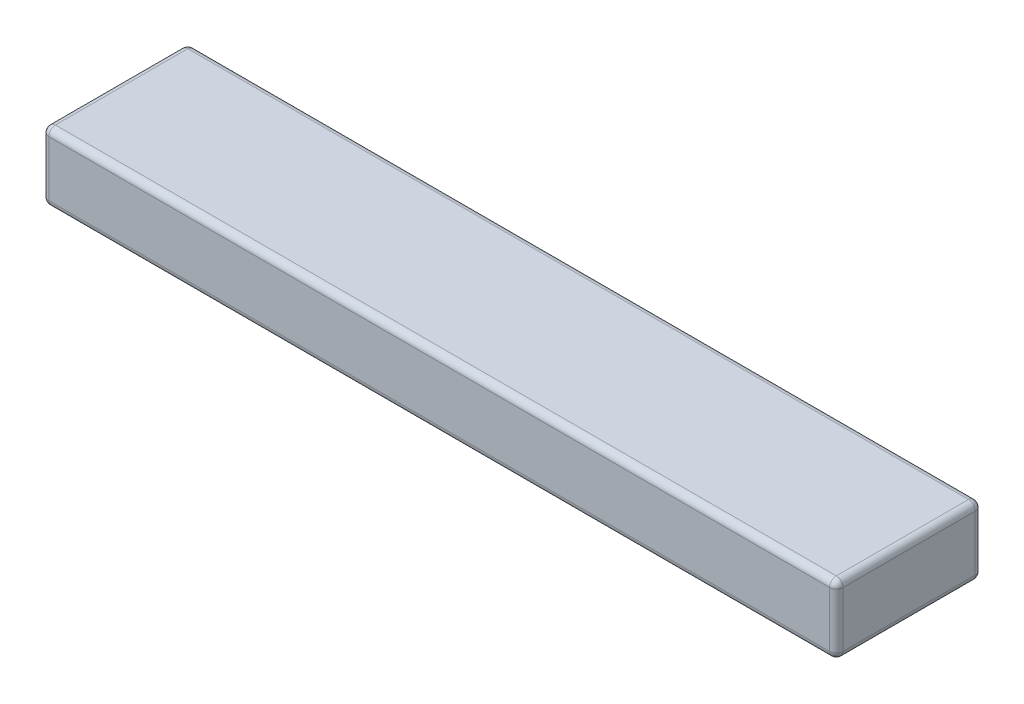
ISO-10303-21;
HEADER;
FILE_DESCRIPTION(('STEP AP214'),'2;1');
FILE_NAME('part.step','',(''),(''),'','','');
FILE_SCHEMA(('AUTOMOTIVE_DESIGN { 1 0 10303 214 1 1 1 1 }'));
ENDSEC;
DATA;
#1=APPLICATION_CONTEXT('core data for automotive mechanical design processes');
#2=APPLICATION_PROTOCOL_DEFINITION('international standard','automotive_design',2000,#1);
#3=PRODUCT_CONTEXT('',#1,'mechanical');
#4=PRODUCT('Part','Part','',(#3));
#5=PRODUCT_RELATED_PRODUCT_CATEGORY('part','',(#4));
#6=PRODUCT_DEFINITION_FORMATION('','',#4);
#7=PRODUCT_DEFINITION_CONTEXT('part definition',#1,'design');
#8=PRODUCT_DEFINITION('design','',#6,#7);
#9=PRODUCT_DEFINITION_SHAPE('','',#8);
#10=(LENGTH_UNIT() NAMED_UNIT(*) SI_UNIT(.MILLI.,.METRE.));
#11=(NAMED_UNIT(*) PLANE_ANGLE_UNIT() SI_UNIT($,.RADIAN.));
#12=(NAMED_UNIT(*) SI_UNIT($,.STERADIAN.) SOLID_ANGLE_UNIT());
#13=UNCERTAINTY_MEASURE_WITH_UNIT(LENGTH_MEASURE(1.E-05),#10,'distance_accuracy_value','');
#14=(GEOMETRIC_REPRESENTATION_CONTEXT(3) GLOBAL_UNCERTAINTY_ASSIGNED_CONTEXT((#13)) GLOBAL_UNIT_ASSIGNED_CONTEXT((#10,
#11,#12)) REPRESENTATION_CONTEXT('',''));
#15=CARTESIAN_POINT('',(0.,0.,0.));
#16=DIRECTION('',(0.,0.,1.));
#17=DIRECTION('',(1.,0.,0.));
#18=AXIS2_PLACEMENT_3D('',#15,#16,#17);
#19=CARTESIAN_POINT('',(-150.,26.,27.5));
#20=DIRECTION('',(1.,0.,0.));
#21=DIRECTION('',(0.,0.,-1.));
#22=AXIS2_PLACEMENT_3D('',#19,#20,#21);
#23=PLANE('',#22);
#24=DIRECTION('',(0.,-1.,0.));
#25=VECTOR('',#24,1.);
#26=CARTESIAN_POINT('',(-150.,26.,-24.96));
#27=LINE('',#26,#25);
#28=CARTESIAN_POINT('',(-150.,23.46,-24.96));
#29=VERTEX_POINT('',#28);
#30=CARTESIAN_POINT('',(-150.,2.54,-24.96));
#31=VERTEX_POINT('',#30);
#32=EDGE_CURVE('E129',#29,#31,#27,.T.);
#33=ORIENTED_EDGE('',*,*,#32,.T.);
#34=DIRECTION('',(0.,0.,1.));
#35=VECTOR('',#34,1.);
#36=CARTESIAN_POINT('',(-150.,2.54,27.5));
#37=LINE('',#36,#35);
#38=CARTESIAN_POINT('',(-150.,2.54,24.96));
#39=VERTEX_POINT('',#38);
#40=EDGE_CURVE('E125',#31,#39,#37,.T.);
#41=ORIENTED_EDGE('',*,*,#40,.T.);
#42=DIRECTION('',(0.,-1.,0.));
#43=VECTOR('',#42,1.);
#44=CARTESIAN_POINT('',(-150.,26.,24.96));
#45=LINE('',#44,#43);
#46=CARTESIAN_POINT('',(-150.,23.46,24.96));
#47=VERTEX_POINT('',#46);
#48=EDGE_CURVE('E120',#39,#47,#45,.F.);
#49=ORIENTED_EDGE('',*,*,#48,.T.);
#50=DIRECTION('',(0.,0.,1.));
#51=VECTOR('',#50,1.);
#52=CARTESIAN_POINT('',(-150.,23.46,-27.5));
#53=LINE('',#52,#51);
#54=EDGE_CURVE('E122',#47,#29,#53,.F.);
#55=ORIENTED_EDGE('',*,*,#54,.T.);
#56=EDGE_LOOP('',(#33,#41,#49,#55));
#57=FACE_BOUND('',#56,.T.);
#58=ADVANCED_FACE('F32',(#57),#23,.F.);
#59=CARTESIAN_POINT('',(150.,26.,27.5));
#60=DIRECTION('',(0.,0.,-1.));
#61=DIRECTION('',(-1.,0.,0.));
#62=AXIS2_PLACEMENT_3D('',#59,#60,#61);
#63=PLANE('',#62);
#64=DIRECTION('',(0.,-1.,0.));
#65=VECTOR('',#64,1.);
#66=CARTESIAN_POINT('',(-147.46,26.,27.5));
#67=LINE('',#66,#65);
#68=CARTESIAN_POINT('',(-147.46,23.46,27.5));
#69=VERTEX_POINT('',#68);
#70=CARTESIAN_POINT('',(-147.46,2.54,27.5));
#71=VERTEX_POINT('',#70);
#72=EDGE_CURVE('E151',#69,#71,#67,.T.);
#73=ORIENTED_EDGE('',*,*,#72,.T.);
#74=DIRECTION('',(1.,0.,0.));
#75=VECTOR('',#74,1.);
#76=CARTESIAN_POINT('',(150.,2.54,27.5));
#77=LINE('',#76,#75);
#78=CARTESIAN_POINT('',(147.46,2.54,27.5));
#79=VERTEX_POINT('',#78);
#80=EDGE_CURVE('E229',#71,#79,#77,.T.);
#81=ORIENTED_EDGE('',*,*,#80,.T.);
#82=DIRECTION('',(0.,-1.,0.));
#83=VECTOR('',#82,1.);
#84=CARTESIAN_POINT('',(147.46,26.,27.5));
#85=LINE('',#84,#83);
#86=CARTESIAN_POINT('',(147.46,23.46,27.5));
#87=VERTEX_POINT('',#86);
#88=EDGE_CURVE('E222',#79,#87,#85,.F.);
#89=ORIENTED_EDGE('',*,*,#88,.T.);
#90=DIRECTION('',(1.,0.,0.));
#91=VECTOR('',#90,1.);
#92=CARTESIAN_POINT('',(-150.,23.46,27.5));
#93=LINE('',#92,#91);
#94=EDGE_CURVE('E220',#87,#69,#93,.F.);
#95=ORIENTED_EDGE('',*,*,#94,.T.);
#96=EDGE_LOOP('',(#73,#81,#89,#95));
#97=FACE_BOUND('',#96,.T.);
#98=ADVANCED_FACE('F319',(#97),#63,.F.);
#99=CARTESIAN_POINT('',(150.,26.,27.5));
#100=DIRECTION('',(-1.,0.,0.));
#101=DIRECTION('',(0.,0.,1.));
#102=AXIS2_PLACEMENT_3D('',#99,#100,#101);
#103=PLANE('',#102);
#104=DIRECTION('',(0.,0.,-1.));
#105=VECTOR('',#104,1.);
#106=CARTESIAN_POINT('',(150.,2.54,27.5));
#107=LINE('',#106,#105);
#108=CARTESIAN_POINT('',(150.,2.54,24.96));
#109=VERTEX_POINT('',#108);
#110=CARTESIAN_POINT('',(150.,2.54,-24.96));
#111=VERTEX_POINT('',#110);
#112=EDGE_CURVE('E216',#109,#111,#107,.T.);
#113=ORIENTED_EDGE('',*,*,#112,.T.);
#114=DIRECTION('',(0.,-1.,0.));
#115=VECTOR('',#114,1.);
#116=CARTESIAN_POINT('',(150.,26.,-24.96));
#117=LINE('',#116,#115);
#118=CARTESIAN_POINT('',(150.,23.46,-24.96));
#119=VERTEX_POINT('',#118);
#120=EDGE_CURVE('E213',#111,#119,#117,.F.);
#121=ORIENTED_EDGE('',*,*,#120,.T.);
#122=DIRECTION('',(0.,0.,-1.));
#123=VECTOR('',#122,1.);
#124=CARTESIAN_POINT('',(150.,23.46,27.5));
#125=LINE('',#124,#123);
#126=CARTESIAN_POINT('',(150.,23.46,24.96));
#127=VERTEX_POINT('',#126);
#128=EDGE_CURVE('E206',#119,#127,#125,.F.);
#129=ORIENTED_EDGE('',*,*,#128,.T.);
#130=DIRECTION('',(0.,-1.,0.));
#131=VECTOR('',#130,1.);
#132=CARTESIAN_POINT('',(150.,26.,24.96));
#133=LINE('',#132,#131);
#134=EDGE_CURVE('E209',#127,#109,#133,.T.);
#135=ORIENTED_EDGE('',*,*,#134,.T.);
#136=EDGE_LOOP('',(#113,#121,#129,#135));
#137=FACE_BOUND('',#136,.T.);
#138=ADVANCED_FACE('F214',(#137),#103,.F.);
#139=CARTESIAN_POINT('',(150.,26.,-27.5));
#140=DIRECTION('',(0.,0.,1.));
#141=DIRECTION('',(1.,0.,0.));
#142=AXIS2_PLACEMENT_3D('',#139,#140,#141);
#143=PLANE('',#142);
#144=DIRECTION('',(-1.,0.,0.));
#145=VECTOR('',#144,1.);
#146=CARTESIAN_POINT('',(150.,2.54,-27.5));
#147=LINE('',#146,#145);
#148=CARTESIAN_POINT('',(147.46,2.54,-27.5));
#149=VERTEX_POINT('',#148);
#150=CARTESIAN_POINT('',(-147.46,2.54,-27.5));
#151=VERTEX_POINT('',#150);
#152=EDGE_CURVE('E278',#149,#151,#147,.T.);
#153=ORIENTED_EDGE('',*,*,#152,.T.);
#154=DIRECTION('',(0.,-1.,0.));
#155=VECTOR('',#154,1.);
#156=CARTESIAN_POINT('',(-147.46,26.,-27.5));
#157=LINE('',#156,#155);
#158=CARTESIAN_POINT('',(-147.46,23.46,-27.5));
#159=VERTEX_POINT('',#158);
#160=EDGE_CURVE('E210',#151,#159,#157,.F.);
#161=ORIENTED_EDGE('',*,*,#160,.T.);
#162=DIRECTION('',(-1.,0.,0.));
#163=VECTOR('',#162,1.);
#164=CARTESIAN_POINT('',(150.,23.46,-27.5));
#165=LINE('',#164,#163);
#166=CARTESIAN_POINT('',(147.46,23.46,-27.5));
#167=VERTEX_POINT('',#166);
#168=EDGE_CURVE('E271',#159,#167,#165,.F.);
#169=ORIENTED_EDGE('',*,*,#168,.T.);
#170=DIRECTION('',(0.,-1.,0.));
#171=VECTOR('',#170,1.);
#172=CARTESIAN_POINT('',(147.46,26.,-27.5));
#173=LINE('',#172,#171);
#174=EDGE_CURVE('E273',#167,#149,#173,.T.);
#175=ORIENTED_EDGE('',*,*,#174,.T.);
#176=EDGE_LOOP('',(#153,#161,#169,#175));
#177=FACE_BOUND('',#176,.T.);
#178=ADVANCED_FACE('F303',(#177),#143,.F.);
#179=CARTESIAN_POINT('',(-150.,26.,-27.5));
#180=DIRECTION('',(0.,1.,0.));
#181=DIRECTION('',(0.,0.,1.));
#182=AXIS2_PLACEMENT_3D('',#179,#180,#181);
#183=PLANE('',#182);
#184=DIRECTION('',(0.,0.,-1.));
#185=VECTOR('',#184,1.);
#186=CARTESIAN_POINT('',(147.46,26.,-27.5));
#187=LINE('',#186,#185);
#188=CARTESIAN_POINT('',(147.46,26.,24.96));
#189=VERTEX_POINT('',#188);
#190=CARTESIAN_POINT('',(147.46,26.,-24.96));
#191=VERTEX_POINT('',#190);
#192=EDGE_CURVE('E41',#189,#191,#187,.T.);
#193=ORIENTED_EDGE('',*,*,#192,.T.);
#194=DIRECTION('',(-1.,0.,0.));
#195=VECTOR('',#194,1.);
#196=CARTESIAN_POINT('',(-150.,26.,-24.96));
#197=LINE('',#196,#195);
#198=CARTESIAN_POINT('',(-147.46,26.,-24.96));
#199=VERTEX_POINT('',#198);
#200=EDGE_CURVE('E11',#191,#199,#197,.T.);
#201=ORIENTED_EDGE('',*,*,#200,.T.);
#202=DIRECTION('',(0.,0.,1.));
#203=VECTOR('',#202,1.);
#204=CARTESIAN_POINT('',(-147.46,26.,27.5));
#205=LINE('',#204,#203);
#206=CARTESIAN_POINT('',(-147.46,26.,24.96));
#207=VERTEX_POINT('',#206);
#208=EDGE_CURVE('E231',#199,#207,#205,.T.);
#209=ORIENTED_EDGE('',*,*,#208,.T.);
#210=DIRECTION('',(1.,0.,0.));
#211=VECTOR('',#210,1.);
#212=CARTESIAN_POINT('',(150.,26.,24.96));
#213=LINE('',#212,#211);
#214=EDGE_CURVE('E52',#207,#189,#213,.T.);
#215=ORIENTED_EDGE('',*,*,#214,.T.);
#216=EDGE_LOOP('',(#193,#201,#209,#215));
#217=FACE_BOUND('',#216,.T.);
#218=ADVANCED_FACE('F482',(#217),#183,.T.);
#219=CARTESIAN_POINT('',(-150.,0.,-27.5));
#220=DIRECTION('',(0.,1.,0.));
#221=DIRECTION('',(0.,0.,1.));
#222=AXIS2_PLACEMENT_3D('',#219,#220,#221);
#223=PLANE('',#222);
#224=DIRECTION('',(1.,0.,0.));
#225=VECTOR('',#224,1.);
#226=CARTESIAN_POINT('',(-150.,0.,24.96));
#227=LINE('',#226,#225);
#228=CARTESIAN_POINT('',(147.46,0.,24.96));
#229=VERTEX_POINT('',#228);
#230=CARTESIAN_POINT('',(-147.46,0.,24.96));
#231=VERTEX_POINT('',#230);
#232=EDGE_CURVE('E267',#229,#231,#227,.F.);
#233=ORIENTED_EDGE('',*,*,#232,.T.);
#234=DIRECTION('',(0.,0.,1.));
#235=VECTOR('',#234,1.);
#236=CARTESIAN_POINT('',(-147.46,0.,-27.5));
#237=LINE('',#236,#235);
#238=CARTESIAN_POINT('',(-147.46,0.,-24.96));
#239=VERTEX_POINT('',#238);
#240=EDGE_CURVE('E261',#231,#239,#237,.F.);
#241=ORIENTED_EDGE('',*,*,#240,.T.);
#242=DIRECTION('',(-1.,0.,0.));
#243=VECTOR('',#242,1.);
#244=CARTESIAN_POINT('',(-150.,0.,-24.96));
#245=LINE('',#244,#243);
#246=CARTESIAN_POINT('',(147.46,0.,-24.96));
#247=VERTEX_POINT('',#246);
#248=EDGE_CURVE('E255',#239,#247,#245,.F.);
#249=ORIENTED_EDGE('',*,*,#248,.T.);
#250=DIRECTION('',(0.,0.,-1.));
#251=VECTOR('',#250,1.);
#252=CARTESIAN_POINT('',(147.46,0.,-27.5));
#253=LINE('',#252,#251);
#254=EDGE_CURVE('E262',#247,#229,#253,.F.);
#255=ORIENTED_EDGE('',*,*,#254,.T.);
#256=EDGE_LOOP('',(#233,#241,#249,#255));
#257=FACE_BOUND('',#256,.T.);
#258=ADVANCED_FACE('F265',(#257),#223,.F.);
#259=CARTESIAN_POINT('',(147.46,23.46,-27.5));
#260=DIRECTION('',(0.,0.,1.));
#261=DIRECTION('',(1.,0.,0.));
#262=AXIS2_PLACEMENT_3D('',#259,#260,#261);
#263=CYLINDRICAL_SURFACE('',#262,2.54);
#264=CARTESIAN_POINT('',(147.46,23.46,-24.96));
#265=DIRECTION('',(0.,0.,-1.));
#266=DIRECTION('',(-1.,0.,0.));
#267=AXIS2_PLACEMENT_3D('',#264,#265,#266);
#268=CIRCLE('',#267,2.54);
#269=EDGE_CURVE('E36',#191,#119,#268,.T.);
#270=ORIENTED_EDGE('',*,*,#269,.F.);
#271=ORIENTED_EDGE('',*,*,#192,.F.);
#272=CARTESIAN_POINT('',(147.46,23.46,24.96));
#273=DIRECTION('',(0.,0.,1.));
#274=DIRECTION('',(1.,0.,0.));
#275=AXIS2_PLACEMENT_3D('',#272,#273,#274);
#276=CIRCLE('',#275,2.54);
#277=EDGE_CURVE('E191',#127,#189,#276,.T.);
#278=ORIENTED_EDGE('',*,*,#277,.F.);
#279=ORIENTED_EDGE('',*,*,#128,.F.);
#280=EDGE_LOOP('',(#270,#271,#278,#279));
#281=FACE_BOUND('',#280,.T.);
#282=ADVANCED_FACE('F34',(#281),#263,.T.);
#283=CARTESIAN_POINT('',(147.46,23.46,-24.96));
#284=DIRECTION('',(0.,0.,1.));
#285=DIRECTION('',(1.,0.,0.));
#286=AXIS2_PLACEMENT_3D('',#283,#284,#285);
#287=SPHERICAL_SURFACE('',#286,2.54);
#288=CARTESIAN_POINT('',(147.46,23.46,-24.96));
#289=DIRECTION('',(1.,0.,0.));
#290=DIRECTION('',(0.,0.,-1.));
#291=AXIS2_PLACEMENT_3D('',#288,#289,#290);
#292=CIRCLE('',#291,2.54);
#293=EDGE_CURVE('E187',#191,#167,#292,.F.);
#294=ORIENTED_EDGE('',*,*,#293,.F.);
#295=ORIENTED_EDGE('',*,*,#269,.T.);
#296=CARTESIAN_POINT('',(147.46,23.46,-24.96));
#297=DIRECTION('',(0.,1.,0.));
#298=DIRECTION('',(0.,0.,1.));
#299=AXIS2_PLACEMENT_3D('',#296,#297,#298);
#300=CIRCLE('',#299,2.54);
#301=EDGE_CURVE('E190',#167,#119,#300,.F.);
#302=ORIENTED_EDGE('',*,*,#301,.F.);
#303=EDGE_LOOP('',(#294,#295,#302));
#304=FACE_BOUND('',#303,.T.);
#305=ADVANCED_FACE('F202',(#304),#287,.T.);
#306=CARTESIAN_POINT('',(147.46,23.46,24.96));
#307=DIRECTION('',(0.,0.,1.));
#308=DIRECTION('',(1.,0.,0.));
#309=AXIS2_PLACEMENT_3D('',#306,#307,#308);
#310=SPHERICAL_SURFACE('',#309,2.54);
#311=CARTESIAN_POINT('',(147.46,23.46,24.96));
#312=DIRECTION('',(0.,1.,0.));
#313=DIRECTION('',(0.,0.,1.));
#314=AXIS2_PLACEMENT_3D('',#311,#312,#313);
#315=CIRCLE('',#314,2.54);
#316=EDGE_CURVE('E181',#127,#87,#315,.F.);
#317=ORIENTED_EDGE('',*,*,#316,.F.);
#318=ORIENTED_EDGE('',*,*,#277,.T.);
#319=CARTESIAN_POINT('',(147.46,23.46,24.96));
#320=DIRECTION('',(1.,0.,0.));
#321=DIRECTION('',(0.,0.,-1.));
#322=AXIS2_PLACEMENT_3D('',#319,#320,#321);
#323=CIRCLE('',#322,2.54);
#324=EDGE_CURVE('E184',#87,#189,#323,.F.);
#325=ORIENTED_EDGE('',*,*,#324,.F.);
#326=EDGE_LOOP('',(#317,#318,#325));
#327=FACE_BOUND('',#326,.T.);
#328=ADVANCED_FACE('F455',(#327),#310,.T.);
#329=CARTESIAN_POINT('',(147.46,26.,-24.96));
#330=DIRECTION('',(0.,-1.,0.));
#331=DIRECTION('',(0.,0.,-1.));
#332=AXIS2_PLACEMENT_3D('',#329,#330,#331);
#333=CYLINDRICAL_SURFACE('',#332,2.54);
#334=ORIENTED_EDGE('',*,*,#301,.T.);
#335=ORIENTED_EDGE('',*,*,#120,.F.);
#336=CARTESIAN_POINT('',(147.46,2.54,-24.96));
#337=DIRECTION('',(0.,-1.,0.));
#338=DIRECTION('',(0.,0.,-1.));
#339=AXIS2_PLACEMENT_3D('',#336,#337,#338);
#340=CIRCLE('',#339,2.54);
#341=EDGE_CURVE('E175',#149,#111,#340,.T.);
#342=ORIENTED_EDGE('',*,*,#341,.F.);
#343=ORIENTED_EDGE('',*,*,#174,.F.);
#344=EDGE_LOOP('',(#334,#335,#342,#343));
#345=FACE_BOUND('',#344,.T.);
#346=ADVANCED_FACE('F305',(#345),#333,.T.);
#347=CARTESIAN_POINT('',(-150.,23.46,-24.96));
#348=DIRECTION('',(1.,0.,0.));
#349=DIRECTION('',(0.,0.,-1.));
#350=AXIS2_PLACEMENT_3D('',#347,#348,#349);
#351=CYLINDRICAL_SURFACE('',#350,2.54);
#352=ORIENTED_EDGE('',*,*,#293,.T.);
#353=ORIENTED_EDGE('',*,*,#168,.F.);
#354=CARTESIAN_POINT('',(-147.46,23.46,-24.96));
#355=DIRECTION('',(-1.,0.,0.));
#356=DIRECTION('',(0.,0.,1.));
#357=AXIS2_PLACEMENT_3D('',#354,#355,#356);
#358=CIRCLE('',#357,2.54);
#359=EDGE_CURVE('E172',#199,#159,#358,.T.);
#360=ORIENTED_EDGE('',*,*,#359,.F.);
#361=ORIENTED_EDGE('',*,*,#200,.F.);
#362=EDGE_LOOP('',(#352,#353,#360,#361));
#363=FACE_BOUND('',#362,.T.);
#364=ADVANCED_FACE('F439',(#363),#351,.T.);
#365=CARTESIAN_POINT('',(-147.46,23.46,-27.5));
#366=DIRECTION('',(0.,0.,-1.));
#367=DIRECTION('',(-1.,0.,0.));
#368=AXIS2_PLACEMENT_3D('',#365,#366,#367);
#369=CYLINDRICAL_SURFACE('',#368,2.54);
#370=CARTESIAN_POINT('',(-147.46,23.46,24.96));
#371=DIRECTION('',(0.,0.,1.));
#372=DIRECTION('',(1.,0.,0.));
#373=AXIS2_PLACEMENT_3D('',#370,#371,#372);
#374=CIRCLE('',#373,2.54);
#375=EDGE_CURVE('E136',#207,#47,#374,.T.);
#376=ORIENTED_EDGE('',*,*,#375,.F.);
#377=ORIENTED_EDGE('',*,*,#208,.F.);
#378=CARTESIAN_POINT('',(-147.46,23.46,-24.96));
#379=DIRECTION('',(0.,0.,-1.));
#380=DIRECTION('',(-1.,0.,0.));
#381=AXIS2_PLACEMENT_3D('',#378,#379,#380);
#382=CIRCLE('',#381,2.54);
#383=EDGE_CURVE('E138',#29,#199,#382,.T.);
#384=ORIENTED_EDGE('',*,*,#383,.F.);
#385=ORIENTED_EDGE('',*,*,#54,.F.);
#386=EDGE_LOOP('',(#376,#377,#384,#385));
#387=FACE_BOUND('',#386,.T.);
#388=ADVANCED_FACE('F134',(#387),#369,.T.);
#389=CARTESIAN_POINT('',(-150.,23.46,24.96));
#390=DIRECTION('',(-1.,0.,0.));
#391=DIRECTION('',(0.,0.,1.));
#392=AXIS2_PLACEMENT_3D('',#389,#390,#391);
#393=CYLINDRICAL_SURFACE('',#392,2.54);
#394=ORIENTED_EDGE('',*,*,#324,.T.);
#395=ORIENTED_EDGE('',*,*,#214,.F.);
#396=CARTESIAN_POINT('',(-147.46,23.46,24.96));
#397=DIRECTION('',(-1.,0.,0.));
#398=DIRECTION('',(0.,-1.,0.));
#399=AXIS2_PLACEMENT_3D('',#396,#397,#398);
#400=CIRCLE('',#399,2.54);
#401=EDGE_CURVE('E147',#69,#207,#400,.T.);
#402=ORIENTED_EDGE('',*,*,#401,.F.);
#403=ORIENTED_EDGE('',*,*,#94,.F.);
#404=EDGE_LOOP('',(#394,#395,#402,#403));
#405=FACE_BOUND('',#404,.T.);
#406=ADVANCED_FACE('F423',(#405),#393,.T.);
#407=CARTESIAN_POINT('',(147.46,26.,24.96));
#408=DIRECTION('',(0.,-1.,0.));
#409=DIRECTION('',(0.,0.,-1.));
#410=AXIS2_PLACEMENT_3D('',#407,#408,#409);
#411=CYLINDRICAL_SURFACE('',#410,2.54);
#412=ORIENTED_EDGE('',*,*,#316,.T.);
#413=ORIENTED_EDGE('',*,*,#88,.F.);
#414=CARTESIAN_POINT('',(147.46,2.54,24.96));
#415=DIRECTION('',(0.,-1.,0.));
#416=DIRECTION('',(0.,0.,-1.));
#417=AXIS2_PLACEMENT_3D('',#414,#415,#416);
#418=CIRCLE('',#417,2.54);
#419=EDGE_CURVE('E167',#109,#79,#418,.T.);
#420=ORIENTED_EDGE('',*,*,#419,.F.);
#421=ORIENTED_EDGE('',*,*,#134,.F.);
#422=EDGE_LOOP('',(#412,#413,#420,#421));
#423=FACE_BOUND('',#422,.T.);
#424=ADVANCED_FACE('F289',(#423),#411,.T.);
#425=CARTESIAN_POINT('',(147.46,2.54,27.5));
#426=DIRECTION('',(0.,0.,-1.));
#427=DIRECTION('',(-1.,0.,0.));
#428=AXIS2_PLACEMENT_3D('',#425,#426,#427);
#429=CYLINDRICAL_SURFACE('',#428,2.54);
#430=CARTESIAN_POINT('',(147.46,2.54,-24.96));
#431=DIRECTION('',(0.,0.,-1.));
#432=DIRECTION('',(-1.,0.,0.));
#433=AXIS2_PLACEMENT_3D('',#430,#431,#432);
#434=CIRCLE('',#433,2.54);
#435=EDGE_CURVE('E178',#111,#247,#434,.T.);
#436=ORIENTED_EDGE('',*,*,#435,.F.);
#437=ORIENTED_EDGE('',*,*,#112,.F.);
#438=CARTESIAN_POINT('',(147.46,2.54,24.96));
#439=DIRECTION('',(0.,0.,1.));
#440=DIRECTION('',(1.,0.,0.));
#441=AXIS2_PLACEMENT_3D('',#438,#439,#440);
#442=CIRCLE('',#441,2.54);
#443=EDGE_CURVE('E164',#229,#109,#442,.T.);
#444=ORIENTED_EDGE('',*,*,#443,.F.);
#445=ORIENTED_EDGE('',*,*,#254,.F.);
#446=EDGE_LOOP('',(#436,#437,#444,#445));
#447=FACE_BOUND('',#446,.T.);
#448=ADVANCED_FACE('F286',(#447),#429,.T.);
#449=CARTESIAN_POINT('',(147.46,2.54,-24.96));
#450=DIRECTION('',(0.,0.,1.));
#451=DIRECTION('',(1.,0.,0.));
#452=AXIS2_PLACEMENT_3D('',#449,#450,#451);
#453=SPHERICAL_SURFACE('',#452,2.54);
#454=ORIENTED_EDGE('',*,*,#341,.T.);
#455=ORIENTED_EDGE('',*,*,#435,.T.);
#456=CARTESIAN_POINT('',(147.46,2.54,-24.96));
#457=DIRECTION('',(1.,0.,0.));
#458=DIRECTION('',(0.,0.,-1.));
#459=AXIS2_PLACEMENT_3D('',#456,#457,#458);
#460=CIRCLE('',#459,2.54);
#461=EDGE_CURVE('E155',#149,#247,#460,.F.);
#462=ORIENTED_EDGE('',*,*,#461,.F.);
#463=EDGE_LOOP('',(#454,#455,#462));
#464=FACE_BOUND('',#463,.T.);
#465=ADVANCED_FACE('F307',(#464),#453,.T.);
#466=CARTESIAN_POINT('',(-147.46,23.46,-24.96));
#467=DIRECTION('',(0.,0.,1.));
#468=DIRECTION('',(1.,0.,0.));
#469=AXIS2_PLACEMENT_3D('',#466,#467,#468);
#470=SPHERICAL_SURFACE('',#469,2.54);
#471=ORIENTED_EDGE('',*,*,#383,.T.);
#472=ORIENTED_EDGE('',*,*,#359,.T.);
#473=CARTESIAN_POINT('',(-147.46,23.46,-24.96));
#474=DIRECTION('',(0.,1.,0.));
#475=DIRECTION('',(0.,0.,1.));
#476=AXIS2_PLACEMENT_3D('',#473,#474,#475);
#477=CIRCLE('',#476,2.54);
#478=EDGE_CURVE('E152',#29,#159,#477,.F.);
#479=ORIENTED_EDGE('',*,*,#478,.F.);
#480=EDGE_LOOP('',(#471,#472,#479));
#481=FACE_BOUND('',#480,.T.);
#482=ADVANCED_FACE('F309',(#481),#470,.T.);
#483=CARTESIAN_POINT('',(-147.46,23.46,24.96));
#484=DIRECTION('',(0.,0.,1.));
#485=DIRECTION('',(1.,0.,0.));
#486=AXIS2_PLACEMENT_3D('',#483,#484,#485);
#487=SPHERICAL_SURFACE('',#486,2.54);
#488=ORIENTED_EDGE('',*,*,#401,.T.);
#489=ORIENTED_EDGE('',*,*,#375,.T.);
#490=CARTESIAN_POINT('',(-147.46,23.46,24.96));
#491=DIRECTION('',(0.,1.,0.));
#492=DIRECTION('',(0.,0.,1.));
#493=AXIS2_PLACEMENT_3D('',#490,#491,#492);
#494=CIRCLE('',#493,2.54);
#495=EDGE_CURVE('E144',#69,#47,#494,.F.);
#496=ORIENTED_EDGE('',*,*,#495,.F.);
#497=EDGE_LOOP('',(#488,#489,#496));
#498=FACE_BOUND('',#497,.T.);
#499=ADVANCED_FACE('F143',(#498),#487,.T.);
#500=CARTESIAN_POINT('',(147.46,2.54,24.96));
#501=DIRECTION('',(0.,0.,1.));
#502=DIRECTION('',(1.,0.,0.));
#503=AXIS2_PLACEMENT_3D('',#500,#501,#502);
#504=SPHERICAL_SURFACE('',#503,2.54);
#505=ORIENTED_EDGE('',*,*,#443,.T.);
#506=ORIENTED_EDGE('',*,*,#419,.T.);
#507=CARTESIAN_POINT('',(147.46,2.54,24.96));
#508=DIRECTION('',(1.,0.,0.));
#509=DIRECTION('',(0.,0.,-1.));
#510=AXIS2_PLACEMENT_3D('',#507,#508,#509);
#511=CIRCLE('',#510,2.54);
#512=EDGE_CURVE('E153',#229,#79,#511,.F.);
#513=ORIENTED_EDGE('',*,*,#512,.F.);
#514=EDGE_LOOP('',(#505,#506,#513));
#515=FACE_BOUND('',#514,.T.);
#516=ADVANCED_FACE('F291',(#515),#504,.T.);
#517=CARTESIAN_POINT('',(150.,2.54,-24.96));
#518=DIRECTION('',(-1.,0.,0.));
#519=DIRECTION('',(0.,0.,1.));
#520=AXIS2_PLACEMENT_3D('',#517,#518,#519);
#521=CYLINDRICAL_SURFACE('',#520,2.54);
#522=ORIENTED_EDGE('',*,*,#461,.T.);
#523=ORIENTED_EDGE('',*,*,#248,.F.);
#524=CARTESIAN_POINT('',(-147.46,2.54,-24.96));
#525=DIRECTION('',(-1.,0.,0.));
#526=DIRECTION('',(0.,0.,1.));
#527=AXIS2_PLACEMENT_3D('',#524,#525,#526);
#528=CIRCLE('',#527,2.54);
#529=EDGE_CURVE('E158',#151,#239,#528,.T.);
#530=ORIENTED_EDGE('',*,*,#529,.F.);
#531=ORIENTED_EDGE('',*,*,#152,.F.);
#532=EDGE_LOOP('',(#522,#523,#530,#531));
#533=FACE_BOUND('',#532,.T.);
#534=ADVANCED_FACE('F257',(#533),#521,.T.);
#535=CARTESIAN_POINT('',(-147.46,26.,-24.96));
#536=DIRECTION('',(0.,-1.,0.));
#537=DIRECTION('',(0.,0.,-1.));
#538=AXIS2_PLACEMENT_3D('',#535,#536,#537);
#539=CYLINDRICAL_SURFACE('',#538,2.54);
#540=ORIENTED_EDGE('',*,*,#478,.T.);
#541=ORIENTED_EDGE('',*,*,#160,.F.);
#542=CARTESIAN_POINT('',(-147.46,2.54,-24.96));
#543=DIRECTION('',(0.,-1.,0.));
#544=DIRECTION('',(0.,0.,-1.));
#545=AXIS2_PLACEMENT_3D('',#542,#543,#544);
#546=CIRCLE('',#545,2.54);
#547=EDGE_CURVE('E244',#31,#151,#546,.T.);
#548=ORIENTED_EDGE('',*,*,#547,.F.);
#549=ORIENTED_EDGE('',*,*,#32,.F.);
#550=EDGE_LOOP('',(#540,#541,#548,#549));
#551=FACE_BOUND('',#550,.T.);
#552=ADVANCED_FACE('F301',(#551),#539,.T.);
#553=CARTESIAN_POINT('',(-147.46,26.,24.96));
#554=DIRECTION('',(0.,-1.,0.));
#555=DIRECTION('',(0.,0.,-1.));
#556=AXIS2_PLACEMENT_3D('',#553,#554,#555);
#557=CYLINDRICAL_SURFACE('',#556,2.54);
#558=ORIENTED_EDGE('',*,*,#495,.T.);
#559=ORIENTED_EDGE('',*,*,#48,.F.);
#560=CARTESIAN_POINT('',(-147.46,2.54,24.96));
#561=DIRECTION('',(0.,-1.,0.));
#562=DIRECTION('',(0.,0.,-1.));
#563=AXIS2_PLACEMENT_3D('',#560,#561,#562);
#564=CIRCLE('',#563,2.54);
#565=EDGE_CURVE('E241',#71,#39,#564,.T.);
#566=ORIENTED_EDGE('',*,*,#565,.F.);
#567=ORIENTED_EDGE('',*,*,#72,.F.);
#568=EDGE_LOOP('',(#558,#559,#566,#567));
#569=FACE_BOUND('',#568,.T.);
#570=ADVANCED_FACE('F149',(#569),#557,.T.);
#571=CARTESIAN_POINT('',(150.,2.54,24.96));
#572=DIRECTION('',(1.,0.,0.));
#573=DIRECTION('',(0.,0.,-1.));
#574=AXIS2_PLACEMENT_3D('',#571,#572,#573);
#575=CYLINDRICAL_SURFACE('',#574,2.54);
#576=ORIENTED_EDGE('',*,*,#512,.T.);
#577=ORIENTED_EDGE('',*,*,#80,.F.);
#578=CARTESIAN_POINT('',(-147.46,2.54,24.96));
#579=DIRECTION('',(-1.,0.,0.));
#580=DIRECTION('',(0.,0.,1.));
#581=AXIS2_PLACEMENT_3D('',#578,#579,#580);
#582=CIRCLE('',#581,2.54);
#583=EDGE_CURVE('E239',#231,#71,#582,.T.);
#584=ORIENTED_EDGE('',*,*,#583,.F.);
#585=ORIENTED_EDGE('',*,*,#232,.F.);
#586=EDGE_LOOP('',(#576,#577,#584,#585));
#587=FACE_BOUND('',#586,.T.);
#588=ADVANCED_FACE('F294',(#587),#575,.T.);
#589=CARTESIAN_POINT('',(-147.46,2.54,-24.96));
#590=DIRECTION('',(0.,0.,1.));
#591=DIRECTION('',(1.,0.,0.));
#592=AXIS2_PLACEMENT_3D('',#589,#590,#591);
#593=SPHERICAL_SURFACE('',#592,2.54);
#594=ORIENTED_EDGE('',*,*,#547,.T.);
#595=ORIENTED_EDGE('',*,*,#529,.T.);
#596=CARTESIAN_POINT('',(-147.46,2.54,-24.96));
#597=DIRECTION('',(0.,0.,-1.));
#598=DIRECTION('',(-1.,0.,0.));
#599=AXIS2_PLACEMENT_3D('',#596,#597,#598);
#600=CIRCLE('',#599,2.54);
#601=EDGE_CURVE('E237',#31,#239,#600,.F.);
#602=ORIENTED_EDGE('',*,*,#601,.F.);
#603=EDGE_LOOP('',(#594,#595,#602));
#604=FACE_BOUND('',#603,.T.);
#605=ADVANCED_FACE('F251',(#604),#593,.T.);
#606=CARTESIAN_POINT('',(-147.46,2.54,24.96));
#607=DIRECTION('',(0.,0.,1.));
#608=DIRECTION('',(1.,0.,0.));
#609=AXIS2_PLACEMENT_3D('',#606,#607,#608);
#610=SPHERICAL_SURFACE('',#609,2.54);
#611=ORIENTED_EDGE('',*,*,#583,.T.);
#612=ORIENTED_EDGE('',*,*,#565,.T.);
#613=CARTESIAN_POINT('',(-147.46,2.54,24.96));
#614=DIRECTION('',(0.,0.,1.));
#615=DIRECTION('',(1.,0.,0.));
#616=AXIS2_PLACEMENT_3D('',#613,#614,#615);
#617=CIRCLE('',#616,2.54);
#618=EDGE_CURVE('E235',#231,#39,#617,.F.);
#619=ORIENTED_EDGE('',*,*,#618,.F.);
#620=EDGE_LOOP('',(#611,#612,#619));
#621=FACE_BOUND('',#620,.T.);
#622=ADVANCED_FACE('F331',(#621),#610,.T.);
#623=CARTESIAN_POINT('',(-147.46,2.54,27.5));
#624=DIRECTION('',(0.,0.,1.));
#625=DIRECTION('',(1.,0.,0.));
#626=AXIS2_PLACEMENT_3D('',#623,#624,#625);
#627=CYLINDRICAL_SURFACE('',#626,2.54);
#628=ORIENTED_EDGE('',*,*,#601,.T.);
#629=ORIENTED_EDGE('',*,*,#240,.F.);
#630=ORIENTED_EDGE('',*,*,#618,.T.);
#631=ORIENTED_EDGE('',*,*,#40,.F.);
#632=EDGE_LOOP('',(#628,#629,#630,#631));
#633=FACE_BOUND('',#632,.T.);
#634=ADVANCED_FACE('F328',(#633),#627,.T.);
#635=CLOSED_SHELL('',(#58,#98,#138,#178,#218,#258,#282,#305,#328,#346,#364,#388,#406,#424,#448,
#465,#482,#499,#516,#534,#552,#570,#588,#605,#622,#634));
#636=MANIFOLD_SOLID_BREP('B2',#635);
#637=ADVANCED_BREP_SHAPE_REPRESENTATION('',(#18,#636),#14);
#638=SHAPE_DEFINITION_REPRESENTATION(#9,#637);
ENDSEC;
END-ISO-10303-21;
